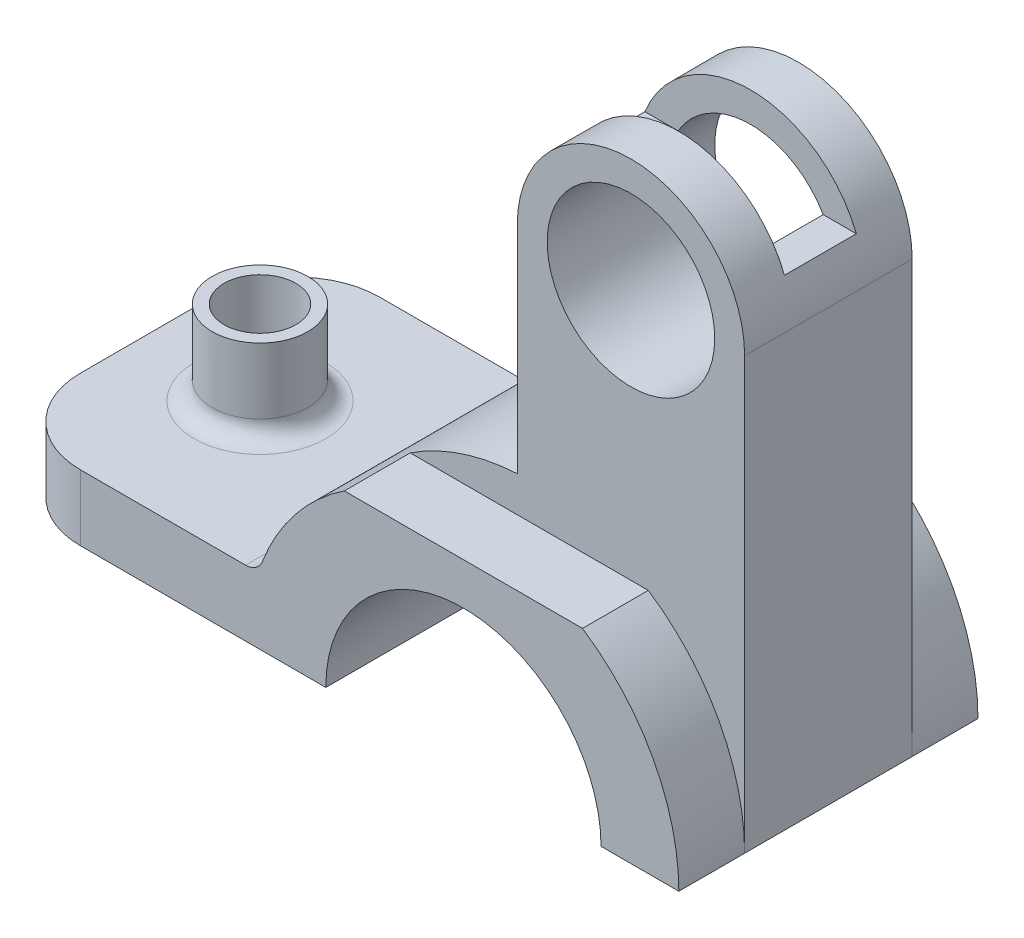
ISO-10303-21;
HEADER;
FILE_DESCRIPTION(('STEP AP214'),'2;1');
FILE_NAME('part.step','',(''),(''),'','','');
FILE_SCHEMA(('AUTOMOTIVE_DESIGN { 1 0 10303 214 1 1 1 1 }'));
ENDSEC;
DATA;
#1=APPLICATION_CONTEXT('core data for automotive mechanical design processes');
#2=APPLICATION_PROTOCOL_DEFINITION('international standard','automotive_design',2000,#1);
#3=PRODUCT_CONTEXT('',#1,'mechanical');
#4=PRODUCT('Part','Part','',(#3));
#5=PRODUCT_RELATED_PRODUCT_CATEGORY('part','',(#4));
#6=PRODUCT_DEFINITION_FORMATION('','',#4);
#7=PRODUCT_DEFINITION_CONTEXT('part definition',#1,'design');
#8=PRODUCT_DEFINITION('design','',#6,#7);
#9=PRODUCT_DEFINITION_SHAPE('','',#8);
#10=(LENGTH_UNIT() NAMED_UNIT(*) SI_UNIT(.MILLI.,.METRE.));
#11=(NAMED_UNIT(*) PLANE_ANGLE_UNIT() SI_UNIT($,.RADIAN.));
#12=(NAMED_UNIT(*) SI_UNIT($,.STERADIAN.) SOLID_ANGLE_UNIT());
#13=UNCERTAINTY_MEASURE_WITH_UNIT(LENGTH_MEASURE(1.E-05),#10,'distance_accuracy_value','');
#14=(GEOMETRIC_REPRESENTATION_CONTEXT(3) GLOBAL_UNCERTAINTY_ASSIGNED_CONTEXT((#13)) GLOBAL_UNIT_ASSIGNED_CONTEXT((#10,
#11,#12)) REPRESENTATION_CONTEXT('',''));
#15=CARTESIAN_POINT('',(0.,0.,0.));
#16=DIRECTION('',(0.,0.,1.));
#17=DIRECTION('',(1.,0.,0.));
#18=AXIS2_PLACEMENT_3D('',#15,#16,#17);
#19=CARTESIAN_POINT('',(78.,0.,25.));
#20=DIRECTION('',(0.,0.,-1.));
#21=DIRECTION('',(-1.,0.,0.));
#22=AXIS2_PLACEMENT_3D('',#19,#20,#21);
#23=CYLINDRICAL_SURFACE('',#22,36.);
#24=CARTESIAN_POINT('',(78.,0.,-14.));
#25=DIRECTION('',(0.,0.,1.));
#26=DIRECTION('',(1.,0.,0.));
#27=AXIS2_PLACEMENT_3D('',#24,#25,#26);
#28=CIRCLE('',#27,36.);
#29=CARTESIAN_POINT('',(114.,0.,-14.));
#30=VERTEX_POINT('',#29);
#31=CARTESIAN_POINT('',(97.8997487421324,30.,-14.));
#32=VERTEX_POINT('',#31);
#33=EDGE_CURVE('E283',#30,#32,#28,.T.);
#34=ORIENTED_EDGE('',*,*,#33,.F.);
#35=DIRECTION('',(0.,0.,-1.));
#36=VECTOR('',#35,1.);
#37=CARTESIAN_POINT('',(114.,0.,25.));
#38=LINE('',#37,#36);
#39=CARTESIAN_POINT('',(114.,0.,-25.));
#40=VERTEX_POINT('',#39);
#41=EDGE_CURVE('E361',#30,#40,#38,.T.);
#42=ORIENTED_EDGE('',*,*,#41,.T.);
#43=CARTESIAN_POINT('',(78.,0.,-25.));
#44=DIRECTION('',(0.,0.,1.));
#45=DIRECTION('',(1.,0.,0.));
#46=AXIS2_PLACEMENT_3D('',#43,#44,#45);
#47=CIRCLE('',#46,36.);
#48=CARTESIAN_POINT('',(97.8997487421324,30.,-25.));
#49=VERTEX_POINT('',#48);
#50=EDGE_CURVE('E342',#40,#49,#47,.T.);
#51=ORIENTED_EDGE('',*,*,#50,.T.);
#52=DIRECTION('',(0.,0.,-1.));
#53=VECTOR('',#52,1.);
#54=CARTESIAN_POINT('',(97.8997487421324,30.,25.));
#55=LINE('',#54,#53);
#56=EDGE_CURVE('E357',#32,#49,#55,.T.);
#57=ORIENTED_EDGE('',*,*,#56,.F.);
#58=EDGE_LOOP('',(#34,#42,#51,#57));
#59=FACE_BOUND('',#58,.T.);
#60=ADVANCED_FACE('F33',(#59),#23,.T.);
#61=CARTESIAN_POINT('',(58.1002512578676,30.,25.));
#62=DIRECTION('',(0.,-1.,0.));
#63=DIRECTION('',(0.,0.,-1.));
#64=AXIS2_PLACEMENT_3D('',#61,#62,#63);
#65=PLANE('',#64);
#66=DIRECTION('',(-1.,0.,0.));
#67=VECTOR('',#66,1.);
#68=CARTESIAN_POINT('',(97.8997487421324,30.,-14.));
#69=LINE('',#68,#67);
#70=CARTESIAN_POINT('',(58.1002512578676,30.,-14.));
#71=VERTEX_POINT('',#70);
#72=EDGE_CURVE('E306',#32,#71,#69,.T.);
#73=ORIENTED_EDGE('',*,*,#72,.F.);
#74=ORIENTED_EDGE('',*,*,#56,.T.);
#75=DIRECTION('',(-1.,0.,0.));
#76=VECTOR('',#75,1.);
#77=CARTESIAN_POINT('',(58.1002512578676,30.,-25.));
#78=LINE('',#77,#76);
#79=CARTESIAN_POINT('',(58.1002512578676,30.,-25.));
#80=VERTEX_POINT('',#79);
#81=EDGE_CURVE('E345',#49,#80,#78,.T.);
#82=ORIENTED_EDGE('',*,*,#81,.T.);
#83=DIRECTION('',(0.,0.,-1.));
#84=VECTOR('',#83,1.);
#85=CARTESIAN_POINT('',(58.1002512578676,30.,25.));
#86=LINE('',#85,#84);
#87=EDGE_CURVE('E353',#71,#80,#86,.T.);
#88=ORIENTED_EDGE('',*,*,#87,.F.);
#89=EDGE_LOOP('',(#73,#74,#82,#88));
#90=FACE_BOUND('',#89,.T.);
#91=ADVANCED_FACE('F391',(#90),#65,.F.);
#92=CARTESIAN_POINT('',(0.,11.,25.));
#93=DIRECTION('',(1.,0.,0.));
#94=DIRECTION('',(0.,1.,0.));
#95=AXIS2_PLACEMENT_3D('',#92,#93,#94);
#96=PLANE('',#95);
#97=DIRECTION('',(0.,0.,-1.));
#98=VECTOR('',#97,1.);
#99=CARTESIAN_POINT('',(0.,11.,25.));
#100=LINE('',#99,#98);
#101=CARTESIAN_POINT('',(0.,11.,11.));
#102=VERTEX_POINT('',#101);
#103=CARTESIAN_POINT('',(0.,11.,-11.));
#104=VERTEX_POINT('',#103);
#105=EDGE_CURVE('E335',#102,#104,#100,.T.);
#106=ORIENTED_EDGE('',*,*,#105,.T.);
#107=DIRECTION('',(0.,-1.,0.));
#108=VECTOR('',#107,1.);
#109=CARTESIAN_POINT('',(0.,0.,-11.));
#110=LINE('',#109,#108);
#111=CARTESIAN_POINT('',(0.,0.,-11.));
#112=VERTEX_POINT('',#111);
#113=EDGE_CURVE('E210',#104,#112,#110,.T.);
#114=ORIENTED_EDGE('',*,*,#113,.T.);
#115=DIRECTION('',(0.,0.,-1.));
#116=VECTOR('',#115,1.);
#117=CARTESIAN_POINT('',(0.,0.,25.));
#118=LINE('',#117,#116);
#119=CARTESIAN_POINT('',(0.,0.,11.));
#120=VERTEX_POINT('',#119);
#121=EDGE_CURVE('E188',#120,#112,#118,.T.);
#122=ORIENTED_EDGE('',*,*,#121,.F.);
#123=DIRECTION('',(0.,-1.,0.));
#124=VECTOR('',#123,1.);
#125=CARTESIAN_POINT('',(0.,11.,11.));
#126=LINE('',#125,#124);
#127=EDGE_CURVE('E208',#120,#102,#126,.F.);
#128=ORIENTED_EDGE('',*,*,#127,.T.);
#129=EDGE_LOOP('',(#106,#114,#122,#128));
#130=FACE_BOUND('',#129,.T.);
#131=ADVANCED_FACE('F398',(#130),#96,.F.);
#132=CARTESIAN_POINT('',(0.,0.,25.));
#133=DIRECTION('',(0.,1.,0.));
#134=DIRECTION('',(0.,0.,1.));
#135=AXIS2_PLACEMENT_3D('',#132,#133,#134);
#136=PLANE('',#135);
#137=CARTESIAN_POINT('',(19.,0.,0.));
#138=DIRECTION('',(0.,1.,0.));
#139=DIRECTION('',(0.,0.,1.));
#140=AXIS2_PLACEMENT_3D('',#137,#138,#139);
#141=CIRCLE('',#140,6.);
#142=CARTESIAN_POINT('',(19.,0.,6.));
#143=VERTEX_POINT('',#142);
#144=EDGE_CURVE('E257',#143,#143,#141,.T.);
#145=ORIENTED_EDGE('',*,*,#144,.T.);
#146=EDGE_LOOP('',(#145));
#147=FACE_BOUND('',#146,.T.);
#148=ORIENTED_EDGE('',*,*,#121,.T.);
#149=CARTESIAN_POINT('',(14.,0.,-11.));
#150=DIRECTION('',(0.,1.,0.));
#151=DIRECTION('',(0.,0.,1.));
#152=AXIS2_PLACEMENT_3D('',#149,#150,#151);
#153=CIRCLE('',#152,14.);
#154=CARTESIAN_POINT('',(14.,0.,-25.));
#155=VERTEX_POINT('',#154);
#156=EDGE_CURVE('E215',#112,#155,#153,.F.);
#157=ORIENTED_EDGE('',*,*,#156,.T.);
#158=DIRECTION('',(1.,0.,0.));
#159=VECTOR('',#158,1.);
#160=CARTESIAN_POINT('',(0.,0.,-25.));
#161=LINE('',#160,#159);
#162=CARTESIAN_POINT('',(55.,0.,-25.));
#163=VERTEX_POINT('',#162);
#164=EDGE_CURVE('E319',#155,#163,#161,.T.);
#165=ORIENTED_EDGE('',*,*,#164,.T.);
#166=DIRECTION('',(0.,0.,-1.));
#167=VECTOR('',#166,1.);
#168=CARTESIAN_POINT('',(55.,0.,25.));
#169=LINE('',#168,#167);
#170=CARTESIAN_POINT('',(55.,0.,25.));
#171=VERTEX_POINT('',#170);
#172=EDGE_CURVE('E368',#171,#163,#169,.T.);
#173=ORIENTED_EDGE('',*,*,#172,.F.);
#174=DIRECTION('',(1.,0.,0.));
#175=VECTOR('',#174,1.);
#176=CARTESIAN_POINT('',(0.,0.,25.));
#177=LINE('',#176,#175);
#178=CARTESIAN_POINT('',(14.,0.,25.));
#179=VERTEX_POINT('',#178);
#180=EDGE_CURVE('E320',#179,#171,#177,.T.);
#181=ORIENTED_EDGE('',*,*,#180,.F.);
#182=CARTESIAN_POINT('',(14.,0.,11.));
#183=DIRECTION('',(0.,1.,0.));
#184=DIRECTION('',(0.,0.,1.));
#185=AXIS2_PLACEMENT_3D('',#182,#183,#184);
#186=CIRCLE('',#185,14.);
#187=EDGE_CURVE('E213',#179,#120,#186,.F.);
#188=ORIENTED_EDGE('',*,*,#187,.T.);
#189=EDGE_LOOP('',(#148,#157,#165,#173,#181,#188));
#190=FACE_BOUND('',#189,.T.);
#191=ADVANCED_FACE('F469',(#147,#190),#136,.F.);
#192=CARTESIAN_POINT('',(78.,0.,25.));
#193=DIRECTION('',(0.,0.,-1.));
#194=DIRECTION('',(-1.,0.,0.));
#195=AXIS2_PLACEMENT_3D('',#192,#193,#194);
#196=CYLINDRICAL_SURFACE('',#195,23.);
#197=CARTESIAN_POINT('',(78.,0.,-25.));
#198=DIRECTION('',(0.,0.,-1.));
#199=DIRECTION('',(-1.,0.,0.));
#200=AXIS2_PLACEMENT_3D('',#197,#198,#199);
#201=CIRCLE('',#200,23.);
#202=CARTESIAN_POINT('',(101.,0.,-25.));
#203=VERTEX_POINT('',#202);
#204=EDGE_CURVE('E337',#163,#203,#201,.T.);
#205=ORIENTED_EDGE('',*,*,#204,.T.);
#206=DIRECTION('',(0.,0.,-1.));
#207=VECTOR('',#206,1.);
#208=CARTESIAN_POINT('',(101.,0.,25.));
#209=LINE('',#208,#207);
#210=CARTESIAN_POINT('',(101.,0.,25.));
#211=VERTEX_POINT('',#210);
#212=EDGE_CURVE('E365',#211,#203,#209,.T.);
#213=ORIENTED_EDGE('',*,*,#212,.F.);
#214=CARTESIAN_POINT('',(78.,0.,25.));
#215=DIRECTION('',(0.,0.,-1.));
#216=DIRECTION('',(-1.,0.,0.));
#217=AXIS2_PLACEMENT_3D('',#214,#215,#216);
#218=CIRCLE('',#217,23.);
#219=EDGE_CURVE('E322',#171,#211,#218,.T.);
#220=ORIENTED_EDGE('',*,*,#219,.F.);
#221=ORIENTED_EDGE('',*,*,#172,.T.);
#222=EDGE_LOOP('',(#205,#213,#220,#221));
#223=FACE_BOUND('',#222,.T.);
#224=ADVANCED_FACE('F413',(#223),#196,.F.);
#225=CARTESIAN_POINT('',(101.,0.,25.));
#226=DIRECTION('',(0.,1.,0.));
#227=DIRECTION('',(0.,0.,1.));
#228=AXIS2_PLACEMENT_3D('',#225,#226,#227);
#229=PLANE('',#228);
#230=DIRECTION('',(1.,0.,0.));
#231=VECTOR('',#230,1.);
#232=CARTESIAN_POINT('',(101.,0.,-25.));
#233=LINE('',#232,#231);
#234=EDGE_CURVE('E339',#203,#40,#233,.T.);
#235=ORIENTED_EDGE('',*,*,#234,.T.);
#236=ORIENTED_EDGE('',*,*,#41,.F.);
#237=DIRECTION('',(0.,0.,-1.));
#238=VECTOR('',#237,1.);
#239=CARTESIAN_POINT('',(114.,0.,14.));
#240=LINE('',#239,#238);
#241=CARTESIAN_POINT('',(114.,0.,14.));
#242=VERTEX_POINT('',#241);
#243=EDGE_CURVE('E295',#242,#30,#240,.T.);
#244=ORIENTED_EDGE('',*,*,#243,.F.);
#245=CARTESIAN_POINT('',(114.,0.,25.));
#246=VERTEX_POINT('',#245);
#247=EDGE_CURVE('E362',#246,#242,#38,.T.);
#248=ORIENTED_EDGE('',*,*,#247,.F.);
#249=DIRECTION('',(1.,0.,0.));
#250=VECTOR('',#249,1.);
#251=CARTESIAN_POINT('',(101.,0.,25.));
#252=LINE('',#251,#250);
#253=EDGE_CURVE('E325',#211,#246,#252,.T.);
#254=ORIENTED_EDGE('',*,*,#253,.F.);
#255=ORIENTED_EDGE('',*,*,#212,.T.);
#256=EDGE_LOOP('',(#235,#236,#244,#248,#254,#255));
#257=FACE_BOUND('',#256,.T.);
#258=ADVANCED_FACE('F405',(#257),#229,.F.);
#259=ORIENTED_EDGE('',*,*,#247,.T.);
#260=CARTESIAN_POINT('',(78.,0.,14.));
#261=DIRECTION('',(0.,0.,1.));
#262=DIRECTION('',(1.,0.,0.));
#263=AXIS2_PLACEMENT_3D('',#260,#261,#262);
#264=CIRCLE('',#263,36.);
#265=CARTESIAN_POINT('',(97.8997487421324,30.,14.));
#266=VERTEX_POINT('',#265);
#267=EDGE_CURVE('E292',#242,#266,#264,.T.);
#268=ORIENTED_EDGE('',*,*,#267,.T.);
#269=CARTESIAN_POINT('',(97.8997487421324,30.,25.));
#270=VERTEX_POINT('',#269);
#271=EDGE_CURVE('E358',#270,#266,#55,.T.);
#272=ORIENTED_EDGE('',*,*,#271,.F.);
#273=CARTESIAN_POINT('',(78.,0.,25.));
#274=DIRECTION('',(0.,0.,1.));
#275=DIRECTION('',(1.,0.,0.));
#276=AXIS2_PLACEMENT_3D('',#273,#274,#275);
#277=CIRCLE('',#276,36.);
#278=EDGE_CURVE('E327',#246,#270,#277,.T.);
#279=ORIENTED_EDGE('',*,*,#278,.F.);
#280=EDGE_LOOP('',(#259,#268,#272,#279));
#281=FACE_BOUND('',#280,.T.);
#282=ADVANCED_FACE('F394',(#281),#23,.T.);
#283=ORIENTED_EDGE('',*,*,#271,.T.);
#284=DIRECTION('',(-1.,0.,0.));
#285=VECTOR('',#284,1.);
#286=CARTESIAN_POINT('',(97.8997487421324,30.,14.));
#287=LINE('',#286,#285);
#288=CARTESIAN_POINT('',(58.1002512578676,30.,14.));
#289=VERTEX_POINT('',#288);
#290=EDGE_CURVE('E289',#266,#289,#287,.T.);
#291=ORIENTED_EDGE('',*,*,#290,.T.);
#292=CARTESIAN_POINT('',(58.1002512578676,30.,25.));
#293=VERTEX_POINT('',#292);
#294=EDGE_CURVE('E354',#293,#289,#86,.T.);
#295=ORIENTED_EDGE('',*,*,#294,.F.);
#296=DIRECTION('',(-1.,0.,0.));
#297=VECTOR('',#296,1.);
#298=CARTESIAN_POINT('',(58.1002512578676,30.,25.));
#299=LINE('',#298,#297);
#300=EDGE_CURVE('E329',#270,#293,#299,.T.);
#301=ORIENTED_EDGE('',*,*,#300,.F.);
#302=EDGE_LOOP('',(#283,#291,#295,#301));
#303=FACE_BOUND('',#302,.T.);
#304=ADVANCED_FACE('F401',(#303),#65,.F.);
#305=CARTESIAN_POINT('',(78.,0.,25.));
#306=DIRECTION('',(0.,0.,-1.));
#307=DIRECTION('',(-1.,0.,0.));
#308=AXIS2_PLACEMENT_3D('',#305,#306,#307);
#309=CYLINDRICAL_SURFACE('',#308,36.);
#310=CARTESIAN_POINT('',(78.,0.,-25.));
#311=DIRECTION('',(0.,0.,1.));
#312=DIRECTION('',(1.,0.,0.));
#313=AXIS2_PLACEMENT_3D('',#310,#311,#312);
#314=CIRCLE('',#313,36.);
#315=CARTESIAN_POINT('',(44.3994928187053,12.9230769230769,-25.));
#316=VERTEX_POINT('',#315);
#317=EDGE_CURVE('E348',#80,#316,#314,.T.);
#318=ORIENTED_EDGE('',*,*,#317,.T.);
#319=DIRECTION('',(0.,0.,-1.));
#320=VECTOR('',#319,1.);
#321=CARTESIAN_POINT('',(44.3994928187053,12.9230769230769,25.));
#322=LINE('',#321,#320);
#323=CARTESIAN_POINT('',(44.3994928187053,12.9230769230769,25.));
#324=VERTEX_POINT('',#323);
#325=EDGE_CURVE('E48',#316,#324,#322,.F.);
#326=ORIENTED_EDGE('',*,*,#325,.T.);
#327=CARTESIAN_POINT('',(78.,0.,25.));
#328=DIRECTION('',(0.,0.,1.));
#329=DIRECTION('',(1.,0.,0.));
#330=AXIS2_PLACEMENT_3D('',#327,#328,#329);
#331=CIRCLE('',#330,36.);
#332=EDGE_CURVE('E331',#293,#324,#331,.T.);
#333=ORIENTED_EDGE('',*,*,#332,.F.);
#334=ORIENTED_EDGE('',*,*,#294,.T.);
#335=CARTESIAN_POINT('',(78.,0.,14.));
#336=DIRECTION('',(0.,0.,1.));
#337=DIRECTION('',(1.,0.,0.));
#338=AXIS2_PLACEMENT_3D('',#335,#336,#337);
#339=CIRCLE('',#338,36.);
#340=CARTESIAN_POINT('',(76.,35.9444015112228,14.));
#341=VERTEX_POINT('',#340);
#342=EDGE_CURVE('E287',#341,#289,#339,.T.);
#343=ORIENTED_EDGE('',*,*,#342,.F.);
#344=DIRECTION('',(0.,0.,-1.));
#345=VECTOR('',#344,1.);
#346=CARTESIAN_POINT('',(76.,35.9444015112228,14.));
#347=LINE('',#346,#345);
#348=CARTESIAN_POINT('',(76.,35.9444015112228,-14.));
#349=VERTEX_POINT('',#348);
#350=EDGE_CURVE('E310',#341,#349,#347,.T.);
#351=ORIENTED_EDGE('',*,*,#350,.T.);
#352=CARTESIAN_POINT('',(78.,0.,-14.));
#353=DIRECTION('',(0.,0.,1.));
#354=DIRECTION('',(1.,0.,0.));
#355=AXIS2_PLACEMENT_3D('',#352,#353,#354);
#356=CIRCLE('',#355,36.);
#357=EDGE_CURVE('E303',#349,#71,#356,.T.);
#358=ORIENTED_EDGE('',*,*,#357,.T.);
#359=ORIENTED_EDGE('',*,*,#87,.T.);
#360=EDGE_LOOP('',(#318,#326,#333,#334,#343,#351,#358,#359));
#361=FACE_BOUND('',#360,.T.);
#362=ADVANCED_FACE('F411',(#361),#309,.T.);
#363=CARTESIAN_POINT('',(43.7217269979948,11.,25.));
#364=DIRECTION('',(0.,-1.,0.));
#365=DIRECTION('',(1.,0.,0.));
#366=AXIS2_PLACEMENT_3D('',#363,#364,#365);
#367=PLANE('',#366);
#368=CARTESIAN_POINT('',(19.,11.,0.));
#369=DIRECTION('',(0.,-1.,0.));
#370=DIRECTION('',(1.,0.,0.));
#371=AXIS2_PLACEMENT_3D('',#368,#369,#370);
#372=CIRCLE('',#371,11.);
#373=CARTESIAN_POINT('',(30.,11.,0.));
#374=VERTEX_POINT('',#373);
#375=EDGE_CURVE('E234',#374,#374,#372,.T.);
#376=ORIENTED_EDGE('',*,*,#375,.T.);
#377=EDGE_LOOP('',(#376));
#378=FACE_BOUND('',#377,.T.);
#379=DIRECTION('',(-1.,0.,0.));
#380=VECTOR('',#379,1.);
#381=CARTESIAN_POINT('',(43.7217269979948,11.,25.));
#382=LINE('',#381,#380);
#383=CARTESIAN_POINT('',(41.5994505535974,11.,25.));
#384=VERTEX_POINT('',#383);
#385=CARTESIAN_POINT('',(14.,11.,25.));
#386=VERTEX_POINT('',#385);
#387=EDGE_CURVE('E333',#384,#386,#382,.T.);
#388=ORIENTED_EDGE('',*,*,#387,.F.);
#389=DIRECTION('',(0.,0.,1.));
#390=VECTOR('',#389,1.);
#391=CARTESIAN_POINT('',(41.5994505535974,11.,-25.));
#392=LINE('',#391,#390);
#393=CARTESIAN_POINT('',(41.5994505535974,11.,-25.));
#394=VERTEX_POINT('',#393);
#395=EDGE_CURVE('E231',#384,#394,#392,.F.);
#396=ORIENTED_EDGE('',*,*,#395,.T.);
#397=DIRECTION('',(-1.,0.,0.));
#398=VECTOR('',#397,1.);
#399=CARTESIAN_POINT('',(43.7217269979948,11.,-25.));
#400=LINE('',#399,#398);
#401=CARTESIAN_POINT('',(14.,11.,-25.));
#402=VERTEX_POINT('',#401);
#403=EDGE_CURVE('E323',#394,#402,#400,.T.);
#404=ORIENTED_EDGE('',*,*,#403,.T.);
#405=CARTESIAN_POINT('',(14.,11.,-11.));
#406=DIRECTION('',(0.,-1.,0.));
#407=DIRECTION('',(1.,0.,0.));
#408=AXIS2_PLACEMENT_3D('',#405,#406,#407);
#409=CIRCLE('',#408,14.);
#410=EDGE_CURVE('E223',#402,#104,#409,.F.);
#411=ORIENTED_EDGE('',*,*,#410,.T.);
#412=ORIENTED_EDGE('',*,*,#105,.F.);
#413=CARTESIAN_POINT('',(14.,11.,11.));
#414=DIRECTION('',(0.,-1.,0.));
#415=DIRECTION('',(1.,0.,0.));
#416=AXIS2_PLACEMENT_3D('',#413,#414,#415);
#417=CIRCLE('',#416,14.);
#418=EDGE_CURVE('E220',#102,#386,#417,.F.);
#419=ORIENTED_EDGE('',*,*,#418,.T.);
#420=EDGE_LOOP('',(#388,#396,#404,#411,#412,#419));
#421=FACE_BOUND('',#420,.T.);
#422=ADVANCED_FACE('F239',(#378,#421),#367,.F.);
#423=CARTESIAN_POINT('',(78.,0.,25.));
#424=DIRECTION('',(0.,0.,-1.));
#425=DIRECTION('',(-1.,0.,0.));
#426=AXIS2_PLACEMENT_3D('',#423,#424,#425);
#427=PLANE('',#426);
#428=ORIENTED_EDGE('',*,*,#332,.T.);
#429=CARTESIAN_POINT('',(41.5994505535974,14.,25.));
#430=DIRECTION('',(0.,0.,-1.));
#431=DIRECTION('',(-1.,0.,0.));
#432=AXIS2_PLACEMENT_3D('',#429,#430,#431);
#433=CIRCLE('',#432,3.);
#434=EDGE_CURVE('E11',#324,#384,#433,.T.);
#435=ORIENTED_EDGE('',*,*,#434,.T.);
#436=ORIENTED_EDGE('',*,*,#387,.T.);
#437=DIRECTION('',(0.,-1.,0.));
#438=VECTOR('',#437,1.);
#439=CARTESIAN_POINT('',(14.,0.,25.));
#440=LINE('',#439,#438);
#441=EDGE_CURVE('E225',#386,#179,#440,.T.);
#442=ORIENTED_EDGE('',*,*,#441,.T.);
#443=ORIENTED_EDGE('',*,*,#180,.T.);
#444=ORIENTED_EDGE('',*,*,#219,.T.);
#445=ORIENTED_EDGE('',*,*,#253,.T.);
#446=ORIENTED_EDGE('',*,*,#278,.T.);
#447=ORIENTED_EDGE('',*,*,#300,.T.);
#448=EDGE_LOOP('',(#428,#435,#436,#442,#443,#444,#445,#446,#447));
#449=FACE_BOUND('',#448,.T.);
#450=ADVANCED_FACE('F446',(#449),#427,.F.);
#451=CARTESIAN_POINT('',(78.,0.,-25.));
#452=DIRECTION('',(0.,0.,-1.));
#453=DIRECTION('',(-1.,0.,0.));
#454=AXIS2_PLACEMENT_3D('',#451,#452,#453);
#455=PLANE('',#454);
#456=ORIENTED_EDGE('',*,*,#164,.F.);
#457=DIRECTION('',(0.,-1.,0.));
#458=VECTOR('',#457,1.);
#459=CARTESIAN_POINT('',(14.,11.,-25.));
#460=LINE('',#459,#458);
#461=EDGE_CURVE('E217',#155,#402,#460,.F.);
#462=ORIENTED_EDGE('',*,*,#461,.T.);
#463=ORIENTED_EDGE('',*,*,#403,.F.);
#464=CARTESIAN_POINT('',(41.5994505535974,14.,-25.));
#465=DIRECTION('',(0.,0.,-1.));
#466=DIRECTION('',(-1.,0.,0.));
#467=AXIS2_PLACEMENT_3D('',#464,#465,#466);
#468=CIRCLE('',#467,3.);
#469=EDGE_CURVE('E41',#394,#316,#468,.F.);
#470=ORIENTED_EDGE('',*,*,#469,.T.);
#471=ORIENTED_EDGE('',*,*,#317,.F.);
#472=ORIENTED_EDGE('',*,*,#81,.F.);
#473=ORIENTED_EDGE('',*,*,#50,.F.);
#474=ORIENTED_EDGE('',*,*,#234,.F.);
#475=ORIENTED_EDGE('',*,*,#204,.F.);
#476=EDGE_LOOP('',(#456,#462,#463,#470,#471,#472,#473,#474,#475));
#477=FACE_BOUND('',#476,.T.);
#478=ADVANCED_FACE('F451',(#477),#455,.T.);
#479=CARTESIAN_POINT('',(114.,0.,14.));
#480=DIRECTION('',(-1.,0.,0.));
#481=DIRECTION('',(0.,0.,1.));
#482=AXIS2_PLACEMENT_3D('',#479,#480,#481);
#483=PLANE('',#482);
#484=DIRECTION('',(0.,1.,0.));
#485=VECTOR('',#484,1.);
#486=CARTESIAN_POINT('',(114.,0.,-14.));
#487=LINE('',#486,#485);
#488=CARTESIAN_POINT('',(114.,72.,-14.));
#489=VERTEX_POINT('',#488);
#490=EDGE_CURVE('E296',#30,#489,#487,.T.);
#491=ORIENTED_EDGE('',*,*,#490,.T.);
#492=DIRECTION('',(0.,0.,-1.));
#493=VECTOR('',#492,1.);
#494=CARTESIAN_POINT('',(114.,72.,14.));
#495=LINE('',#494,#493);
#496=CARTESIAN_POINT('',(114.,72.,14.));
#497=VERTEX_POINT('',#496);
#498=EDGE_CURVE('E316',#497,#489,#495,.T.);
#499=ORIENTED_EDGE('',*,*,#498,.F.);
#500=DIRECTION('',(0.,1.,0.));
#501=VECTOR('',#500,1.);
#502=CARTESIAN_POINT('',(114.,0.,14.));
#503=LINE('',#502,#501);
#504=EDGE_CURVE('E279',#242,#497,#503,.T.);
#505=ORIENTED_EDGE('',*,*,#504,.F.);
#506=ORIENTED_EDGE('',*,*,#243,.T.);
#507=EDGE_LOOP('',(#491,#499,#505,#506));
#508=FACE_BOUND('',#507,.T.);
#509=ADVANCED_FACE('F424',(#508),#483,.F.);
#510=CARTESIAN_POINT('',(95.,72.,14.));
#511=DIRECTION('',(0.,0.,-1.));
#512=DIRECTION('',(-1.,0.,0.));
#513=AXIS2_PLACEMENT_3D('',#510,#511,#512);
#514=CYLINDRICAL_SURFACE('',#513,19.);
#515=DIRECTION('',(0.,0.,-1.));
#516=VECTOR('',#515,1.);
#517=CARTESIAN_POINT('',(112.663521732656,79.,14.));
#518=LINE('',#517,#516);
#519=CARTESIAN_POINT('',(112.663521732656,79.,-5.99999999999999));
#520=VERTEX_POINT('',#519);
#521=CARTESIAN_POINT('',(112.663521732656,79.,6.00000000000001));
#522=VERTEX_POINT('',#521);
#523=EDGE_CURVE('E269',#520,#522,#518,.F.);
#524=ORIENTED_EDGE('',*,*,#523,.T.);
#525=CARTESIAN_POINT('',(95.,72.,6.00000000000001));
#526=DIRECTION('',(0.,0.,1.));
#527=DIRECTION('',(0.,-1.,0.));
#528=AXIS2_PLACEMENT_3D('',#525,#526,#527);
#529=CIRCLE('',#528,19.);
#530=CARTESIAN_POINT('',(77.3364782673443,79.,6.00000000000001));
#531=VERTEX_POINT('',#530);
#532=EDGE_CURVE('E267',#522,#531,#529,.T.);
#533=ORIENTED_EDGE('',*,*,#532,.T.);
#534=DIRECTION('',(0.,0.,-1.));
#535=VECTOR('',#534,1.);
#536=CARTESIAN_POINT('',(77.3364782673443,79.,14.));
#537=LINE('',#536,#535);
#538=CARTESIAN_POINT('',(77.3364782673443,79.,-5.99999999999999));
#539=VERTEX_POINT('',#538);
#540=EDGE_CURVE('E195',#531,#539,#537,.T.);
#541=ORIENTED_EDGE('',*,*,#540,.T.);
#542=CARTESIAN_POINT('',(95.,72.,-5.99999999999999));
#543=DIRECTION('',(0.,0.,-1.));
#544=DIRECTION('',(0.,1.,0.));
#545=AXIS2_PLACEMENT_3D('',#542,#543,#544);
#546=CIRCLE('',#545,19.);
#547=EDGE_CURVE('E273',#539,#520,#546,.T.);
#548=ORIENTED_EDGE('',*,*,#547,.T.);
#549=EDGE_LOOP('',(#524,#533,#541,#548));
#550=FACE_BOUND('',#549,.T.);
#551=CARTESIAN_POINT('',(95.,72.,-14.));
#552=DIRECTION('',(0.,0.,1.));
#553=DIRECTION('',(1.,0.,0.));
#554=AXIS2_PLACEMENT_3D('',#551,#552,#553);
#555=CIRCLE('',#554,19.);
#556=CARTESIAN_POINT('',(76.,72.,-14.));
#557=VERTEX_POINT('',#556);
#558=EDGE_CURVE('E299',#489,#557,#555,.T.);
#559=ORIENTED_EDGE('',*,*,#558,.T.);
#560=DIRECTION('',(0.,0.,-1.));
#561=VECTOR('',#560,1.);
#562=CARTESIAN_POINT('',(76.,72.,14.));
#563=LINE('',#562,#561);
#564=CARTESIAN_POINT('',(76.,72.,14.));
#565=VERTEX_POINT('',#564);
#566=EDGE_CURVE('E313',#565,#557,#563,.T.);
#567=ORIENTED_EDGE('',*,*,#566,.F.);
#568=CARTESIAN_POINT('',(95.,72.,14.));
#569=DIRECTION('',(0.,0.,1.));
#570=DIRECTION('',(1.,0.,0.));
#571=AXIS2_PLACEMENT_3D('',#568,#569,#570);
#572=CIRCLE('',#571,19.);
#573=EDGE_CURVE('E282',#497,#565,#572,.T.);
#574=ORIENTED_EDGE('',*,*,#573,.F.);
#575=ORIENTED_EDGE('',*,*,#498,.T.);
#576=EDGE_LOOP('',(#559,#567,#574,#575));
#577=FACE_BOUND('',#576,.T.);
#578=ADVANCED_FACE('F440',(#550,#577),#514,.T.);
#579=CARTESIAN_POINT('',(76.,72.,14.));
#580=DIRECTION('',(1.,0.,0.));
#581=DIRECTION('',(0.,1.,0.));
#582=AXIS2_PLACEMENT_3D('',#579,#580,#581);
#583=PLANE('',#582);
#584=DIRECTION('',(0.,-1.,0.));
#585=VECTOR('',#584,1.);
#586=CARTESIAN_POINT('',(76.,72.,-14.));
#587=LINE('',#586,#585);
#588=EDGE_CURVE('E301',#557,#349,#587,.T.);
#589=ORIENTED_EDGE('',*,*,#588,.T.);
#590=ORIENTED_EDGE('',*,*,#350,.F.);
#591=DIRECTION('',(0.,-1.,0.));
#592=VECTOR('',#591,1.);
#593=CARTESIAN_POINT('',(76.,72.,14.));
#594=LINE('',#593,#592);
#595=EDGE_CURVE('E285',#565,#341,#594,.T.);
#596=ORIENTED_EDGE('',*,*,#595,.F.);
#597=ORIENTED_EDGE('',*,*,#566,.T.);
#598=EDGE_LOOP('',(#589,#590,#596,#597));
#599=FACE_BOUND('',#598,.T.);
#600=ADVANCED_FACE('F437',(#599),#583,.F.);
#601=CARTESIAN_POINT('',(95.,72.,14.));
#602=DIRECTION('',(0.,0.,1.));
#603=DIRECTION('',(1.,0.,0.));
#604=AXIS2_PLACEMENT_3D('',#601,#602,#603);
#605=PLANE('',#604);
#606=CARTESIAN_POINT('',(95.,72.,14.));
#607=DIRECTION('',(0.,0.,1.));
#608=DIRECTION('',(1.,0.,0.));
#609=AXIS2_PLACEMENT_3D('',#606,#607,#608);
#610=CIRCLE('',#609,14.);
#611=CARTESIAN_POINT('',(109.,72.,14.));
#612=VERTEX_POINT('',#611);
#613=EDGE_CURVE('E275',#612,#612,#610,.T.);
#614=ORIENTED_EDGE('',*,*,#613,.F.);
#615=EDGE_LOOP('',(#614));
#616=FACE_BOUND('',#615,.T.);
#617=ORIENTED_EDGE('',*,*,#504,.T.);
#618=ORIENTED_EDGE('',*,*,#573,.T.);
#619=ORIENTED_EDGE('',*,*,#595,.T.);
#620=ORIENTED_EDGE('',*,*,#342,.T.);
#621=ORIENTED_EDGE('',*,*,#290,.F.);
#622=ORIENTED_EDGE('',*,*,#267,.F.);
#623=EDGE_LOOP('',(#617,#618,#619,#620,#621,#622));
#624=FACE_BOUND('',#623,.T.);
#625=ADVANCED_FACE('F387',(#616,#624),#605,.T.);
#626=CARTESIAN_POINT('',(95.,72.,-14.));
#627=DIRECTION('',(0.,0.,1.));
#628=DIRECTION('',(1.,0.,0.));
#629=AXIS2_PLACEMENT_3D('',#626,#627,#628);
#630=PLANE('',#629);
#631=CARTESIAN_POINT('',(95.,72.,-14.));
#632=DIRECTION('',(0.,0.,1.));
#633=DIRECTION('',(1.,0.,0.));
#634=AXIS2_PLACEMENT_3D('',#631,#632,#633);
#635=CIRCLE('',#634,14.);
#636=CARTESIAN_POINT('',(109.,72.,-14.));
#637=VERTEX_POINT('',#636);
#638=EDGE_CURVE('E278',#637,#637,#635,.T.);
#639=ORIENTED_EDGE('',*,*,#638,.T.);
#640=EDGE_LOOP('',(#639));
#641=FACE_BOUND('',#640,.T.);
#642=ORIENTED_EDGE('',*,*,#490,.F.);
#643=ORIENTED_EDGE('',*,*,#33,.T.);
#644=ORIENTED_EDGE('',*,*,#72,.T.);
#645=ORIENTED_EDGE('',*,*,#357,.F.);
#646=ORIENTED_EDGE('',*,*,#588,.F.);
#647=ORIENTED_EDGE('',*,*,#558,.F.);
#648=EDGE_LOOP('',(#642,#643,#644,#645,#646,#647));
#649=FACE_BOUND('',#648,.T.);
#650=ADVANCED_FACE('F375',(#641,#649),#630,.F.);
#651=CARTESIAN_POINT('',(95.,72.,-83.));
#652=DIRECTION('',(0.,0.,1.));
#653=DIRECTION('',(1.,0.,0.));
#654=AXIS2_PLACEMENT_3D('',#651,#652,#653);
#655=CYLINDRICAL_SURFACE('',#654,14.);
#656=DIRECTION('',(0.,0.,1.));
#657=VECTOR('',#656,1.);
#658=CARTESIAN_POINT('',(107.124355652982,79.,-83.));
#659=LINE('',#658,#657);
#660=CARTESIAN_POINT('',(107.124355652982,79.,6.00000000000001));
#661=VERTEX_POINT('',#660);
#662=CARTESIAN_POINT('',(107.124355652982,79.,-5.99999999999999));
#663=VERTEX_POINT('',#662);
#664=EDGE_CURVE('E202',#661,#663,#659,.F.);
#665=ORIENTED_EDGE('',*,*,#664,.T.);
#666=CARTESIAN_POINT('',(95.,72.,-5.99999999999999));
#667=DIRECTION('',(0.,0.,-1.));
#668=DIRECTION('',(0.,1.,0.));
#669=AXIS2_PLACEMENT_3D('',#666,#667,#668);
#670=CIRCLE('',#669,14.);
#671=CARTESIAN_POINT('',(82.8756443470179,79.,-5.99999999999999));
#672=VERTEX_POINT('',#671);
#673=EDGE_CURVE('E201',#663,#672,#670,.F.);
#674=ORIENTED_EDGE('',*,*,#673,.T.);
#675=DIRECTION('',(0.,0.,1.));
#676=VECTOR('',#675,1.);
#677=CARTESIAN_POINT('',(82.8756443470179,79.,-83.));
#678=LINE('',#677,#676);
#679=CARTESIAN_POINT('',(82.8756443470179,79.,6.00000000000001));
#680=VERTEX_POINT('',#679);
#681=EDGE_CURVE('E187',#672,#680,#678,.T.);
#682=ORIENTED_EDGE('',*,*,#681,.T.);
#683=CARTESIAN_POINT('',(95.,72.,6.00000000000001));
#684=DIRECTION('',(0.,0.,1.));
#685=DIRECTION('',(0.,-1.,0.));
#686=AXIS2_PLACEMENT_3D('',#683,#684,#685);
#687=CIRCLE('',#686,14.);
#688=EDGE_CURVE('E176',#680,#661,#687,.F.);
#689=ORIENTED_EDGE('',*,*,#688,.T.);
#690=EDGE_LOOP('',(#665,#674,#682,#689));
#691=FACE_BOUND('',#690,.T.);
#692=ORIENTED_EDGE('',*,*,#613,.T.);
#693=EDGE_LOOP('',(#692));
#694=FACE_BOUND('',#693,.T.);
#695=ORIENTED_EDGE('',*,*,#638,.F.);
#696=EDGE_LOOP('',(#695));
#697=FACE_BOUND('',#696,.T.);
#698=ADVANCED_FACE('F199',(#691,#694,#697),#655,.F.);
#699=CARTESIAN_POINT('',(17.,91.,-5.99999999999999));
#700=DIRECTION('',(0.,0.,-1.));
#701=DIRECTION('',(0.,1.,0.));
#702=AXIS2_PLACEMENT_3D('',#699,#700,#701);
#703=PLANE('',#702);
#704=ORIENTED_EDGE('',*,*,#547,.F.);
#705=DIRECTION('',(1.,0.,0.));
#706=VECTOR('',#705,1.);
#707=CARTESIAN_POINT('',(17.,79.,-5.99999999999999));
#708=LINE('',#707,#706);
#709=EDGE_CURVE('E265',#539,#672,#708,.T.);
#710=ORIENTED_EDGE('',*,*,#709,.T.);
#711=ORIENTED_EDGE('',*,*,#673,.F.);
#712=EDGE_CURVE('E196',#663,#520,#708,.T.);
#713=ORIENTED_EDGE('',*,*,#712,.T.);
#714=EDGE_LOOP('',(#704,#710,#711,#713));
#715=FACE_BOUND('',#714,.T.);
#716=ADVANCED_FACE('F379',(#715),#703,.F.);
#717=CARTESIAN_POINT('',(17.,79.,6.00000000000001));
#718=DIRECTION('',(0.,-1.,0.));
#719=DIRECTION('',(0.,0.,-1.));
#720=AXIS2_PLACEMENT_3D('',#717,#718,#719);
#721=PLANE('',#720);
#722=DIRECTION('',(1.,0.,0.));
#723=VECTOR('',#722,1.);
#724=CARTESIAN_POINT('',(17.,79.,6.00000000000001));
#725=LINE('',#724,#723);
#726=EDGE_CURVE('E179',#531,#680,#725,.T.);
#727=ORIENTED_EDGE('',*,*,#726,.T.);
#728=ORIENTED_EDGE('',*,*,#681,.F.);
#729=ORIENTED_EDGE('',*,*,#709,.F.);
#730=ORIENTED_EDGE('',*,*,#540,.F.);
#731=EDGE_LOOP('',(#727,#728,#729,#730));
#732=FACE_BOUND('',#731,.T.);
#733=ADVANCED_FACE('F191',(#732),#721,.F.);
#734=ORIENTED_EDGE('',*,*,#712,.F.);
#735=ORIENTED_EDGE('',*,*,#664,.F.);
#736=EDGE_CURVE('E182',#661,#522,#725,.T.);
#737=ORIENTED_EDGE('',*,*,#736,.T.);
#738=ORIENTED_EDGE('',*,*,#523,.F.);
#739=EDGE_LOOP('',(#734,#735,#737,#738));
#740=FACE_BOUND('',#739,.T.);
#741=ADVANCED_FACE('F502',(#740),#721,.F.);
#742=CARTESIAN_POINT('',(17.,91.,6.00000000000001));
#743=DIRECTION('',(0.,0.,1.));
#744=DIRECTION('',(0.,-1.,0.));
#745=AXIS2_PLACEMENT_3D('',#742,#743,#744);
#746=PLANE('',#745);
#747=ORIENTED_EDGE('',*,*,#736,.F.);
#748=ORIENTED_EDGE('',*,*,#688,.F.);
#749=ORIENTED_EDGE('',*,*,#726,.F.);
#750=ORIENTED_EDGE('',*,*,#532,.F.);
#751=EDGE_LOOP('',(#747,#748,#749,#750));
#752=FACE_BOUND('',#751,.T.);
#753=ADVANCED_FACE('F178',(#752),#746,.F.);
#754=CARTESIAN_POINT('',(19.,25.,0.));
#755=DIRECTION('',(0.,-1.,0.));
#756=DIRECTION('',(1.,0.,0.));
#757=AXIS2_PLACEMENT_3D('',#754,#755,#756);
#758=CYLINDRICAL_SURFACE('',#757,8.00000000000001);
#759=CARTESIAN_POINT('',(19.,14.,0.));
#760=DIRECTION('',(0.,-1.,0.));
#761=DIRECTION('',(1.,0.,0.));
#762=AXIS2_PLACEMENT_3D('',#759,#760,#761);
#763=CIRCLE('',#762,8.00000000000001);
#764=CARTESIAN_POINT('',(27.,14.,0.));
#765=VERTEX_POINT('',#764);
#766=EDGE_CURVE('E228',#765,#765,#763,.F.);
#767=ORIENTED_EDGE('',*,*,#766,.T.);
#768=EDGE_LOOP('',(#767));
#769=FACE_BOUND('',#768,.T.);
#770=CARTESIAN_POINT('',(19.,25.,0.));
#771=DIRECTION('',(0.,1.,0.));
#772=DIRECTION('',(-1.,0.,0.));
#773=AXIS2_PLACEMENT_3D('',#770,#771,#772);
#774=CIRCLE('',#773,8.00000000000001);
#775=CARTESIAN_POINT('',(11.,25.,0.));
#776=VERTEX_POINT('',#775);
#777=EDGE_CURVE('E255',#776,#776,#774,.T.);
#778=ORIENTED_EDGE('',*,*,#777,.F.);
#779=EDGE_LOOP('',(#778));
#780=FACE_BOUND('',#779,.T.);
#781=ADVANCED_FACE('F248',(#769,#780),#758,.T.);
#782=CARTESIAN_POINT('',(19.,25.,0.));
#783=DIRECTION('',(0.,1.,0.));
#784=DIRECTION('',(-1.,0.,0.));
#785=AXIS2_PLACEMENT_3D('',#782,#783,#784);
#786=PLANE('',#785);
#787=CARTESIAN_POINT('',(19.,25.,0.));
#788=DIRECTION('',(0.,1.,0.));
#789=DIRECTION('',(-1.,0.,0.));
#790=AXIS2_PLACEMENT_3D('',#787,#788,#789);
#791=CIRCLE('',#790,6.);
#792=CARTESIAN_POINT('',(13.,25.,0.));
#793=VERTEX_POINT('',#792);
#794=EDGE_CURVE('E260',#793,#793,#791,.T.);
#795=ORIENTED_EDGE('',*,*,#794,.F.);
#796=EDGE_LOOP('',(#795));
#797=FACE_BOUND('',#796,.T.);
#798=ORIENTED_EDGE('',*,*,#777,.T.);
#799=EDGE_LOOP('',(#798));
#800=FACE_BOUND('',#799,.T.);
#801=ADVANCED_FACE('F251',(#797,#800),#786,.T.);
#802=CARTESIAN_POINT('',(14.,11.,-11.));
#803=DIRECTION('',(0.,1.,0.));
#804=DIRECTION('',(-1.,0.,0.));
#805=AXIS2_PLACEMENT_3D('',#802,#803,#804);
#806=CYLINDRICAL_SURFACE('',#805,14.);
#807=ORIENTED_EDGE('',*,*,#410,.F.);
#808=ORIENTED_EDGE('',*,*,#461,.F.);
#809=ORIENTED_EDGE('',*,*,#156,.F.);
#810=ORIENTED_EDGE('',*,*,#113,.F.);
#811=EDGE_LOOP('',(#807,#808,#809,#810));
#812=FACE_BOUND('',#811,.T.);
#813=ADVANCED_FACE('F457',(#812),#806,.T.);
#814=CARTESIAN_POINT('',(14.,0.,11.));
#815=DIRECTION('',(0.,-1.,0.));
#816=DIRECTION('',(1.,0.,0.));
#817=AXIS2_PLACEMENT_3D('',#814,#815,#816);
#818=CYLINDRICAL_SURFACE('',#817,14.);
#819=ORIENTED_EDGE('',*,*,#418,.F.);
#820=ORIENTED_EDGE('',*,*,#127,.F.);
#821=ORIENTED_EDGE('',*,*,#187,.F.);
#822=ORIENTED_EDGE('',*,*,#441,.F.);
#823=EDGE_LOOP('',(#819,#820,#821,#822));
#824=FACE_BOUND('',#823,.T.);
#825=ADVANCED_FACE('F464',(#824),#818,.T.);
#826=CARTESIAN_POINT('',(19.,-29.,0.));
#827=DIRECTION('',(0.,1.,0.));
#828=DIRECTION('',(-1.,0.,0.));
#829=AXIS2_PLACEMENT_3D('',#826,#827,#828);
#830=CYLINDRICAL_SURFACE('',#829,6.);
#831=ORIENTED_EDGE('',*,*,#794,.T.);
#832=EDGE_LOOP('',(#831));
#833=FACE_BOUND('',#832,.T.);
#834=ORIENTED_EDGE('',*,*,#144,.F.);
#835=EDGE_LOOP('',(#834));
#836=FACE_BOUND('',#835,.T.);
#837=ADVANCED_FACE('F245',(#833,#836),#830,.F.);
#838=CARTESIAN_POINT('',(19.,14.,0.));
#839=DIRECTION('',(0.,-1.,0.));
#840=DIRECTION('',(1.,0.,0.));
#841=AXIS2_PLACEMENT_3D('',#838,#839,#840);
#842=TOROIDAL_SURFACE('',#841,11.,3.);
#843=ORIENTED_EDGE('',*,*,#375,.F.);
#844=EDGE_LOOP('',(#843));
#845=FACE_BOUND('',#844,.T.);
#846=ORIENTED_EDGE('',*,*,#766,.F.);
#847=EDGE_LOOP('',(#846));
#848=FACE_BOUND('',#847,.T.);
#849=ADVANCED_FACE('F242',(#845,#848),#842,.F.);
#850=CARTESIAN_POINT('',(41.5994505535974,14.,25.));
#851=DIRECTION('',(0.,0.,-1.));
#852=DIRECTION('',(-1.,0.,0.));
#853=AXIS2_PLACEMENT_3D('',#850,#851,#852);
#854=CYLINDRICAL_SURFACE('',#853,3.);
#855=ORIENTED_EDGE('',*,*,#434,.F.);
#856=ORIENTED_EDGE('',*,*,#325,.F.);
#857=ORIENTED_EDGE('',*,*,#469,.F.);
#858=ORIENTED_EDGE('',*,*,#395,.F.);
#859=EDGE_LOOP('',(#855,#856,#857,#858));
#860=FACE_BOUND('',#859,.T.);
#861=ADVANCED_FACE('F35',(#860),#854,.F.);
#862=CLOSED_SHELL('',(#60,#91,#131,#191,#224,#258,#282,#304,#362,#422,#450,#478,#509,#578,#600,
#625,#650,#698,#716,#733,#741,#753,#781,#801,#813,#825,#837,#849,#861));
#863=MANIFOLD_SOLID_BREP('B2',#862);
#864=ADVANCED_BREP_SHAPE_REPRESENTATION('',(#18,#863),#14);
#865=SHAPE_DEFINITION_REPRESENTATION(#9,#864);
ENDSEC;
END-ISO-10303-21;
